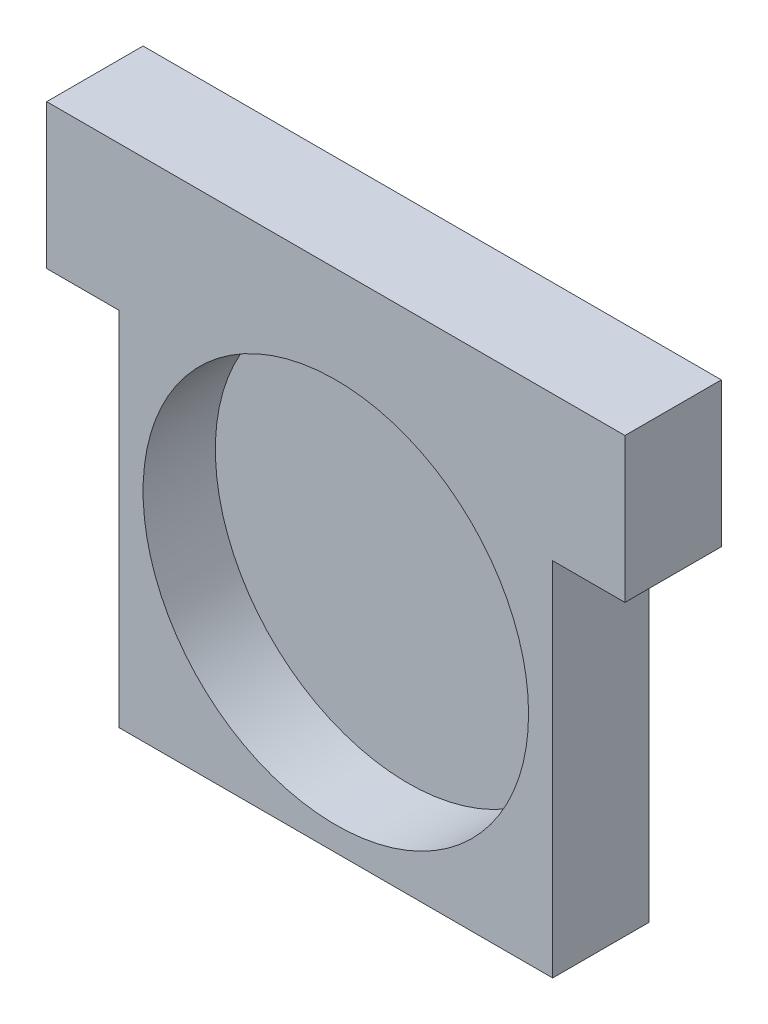
ISO-10303-21;
HEADER;
FILE_DESCRIPTION(('STEP AP214'),'2;1');
FILE_NAME('part.step','',(''),(''),'','','');
FILE_SCHEMA(('AUTOMOTIVE_DESIGN { 1 0 10303 214 1 1 1 1 }'));
ENDSEC;
DATA;
#1=APPLICATION_CONTEXT('core data for automotive mechanical design processes');
#2=APPLICATION_PROTOCOL_DEFINITION('international standard','automotive_design',2000,#1);
#3=PRODUCT_CONTEXT('',#1,'mechanical');
#4=PRODUCT('Part','Part','',(#3));
#5=PRODUCT_RELATED_PRODUCT_CATEGORY('part','',(#4));
#6=PRODUCT_DEFINITION_FORMATION('','',#4);
#7=PRODUCT_DEFINITION_CONTEXT('part definition',#1,'design');
#8=PRODUCT_DEFINITION('design','',#6,#7);
#9=PRODUCT_DEFINITION_SHAPE('','',#8);
#10=(LENGTH_UNIT() NAMED_UNIT(*) SI_UNIT(.MILLI.,.METRE.));
#11=(NAMED_UNIT(*) PLANE_ANGLE_UNIT() SI_UNIT($,.RADIAN.));
#12=(NAMED_UNIT(*) SI_UNIT($,.STERADIAN.) SOLID_ANGLE_UNIT());
#13=UNCERTAINTY_MEASURE_WITH_UNIT(LENGTH_MEASURE(1.E-05),#10,'distance_accuracy_value','');
#14=(GEOMETRIC_REPRESENTATION_CONTEXT(3) GLOBAL_UNCERTAINTY_ASSIGNED_CONTEXT((#13)) GLOBAL_UNIT_ASSIGNED_CONTEXT((#10,
#11,#12)) REPRESENTATION_CONTEXT('',''));
#15=CARTESIAN_POINT('',(0.,0.,0.));
#16=DIRECTION('',(0.,0.,1.));
#17=DIRECTION('',(1.,0.,0.));
#18=AXIS2_PLACEMENT_3D('',#15,#16,#17);
#19=CARTESIAN_POINT('',(38.1,38.1,12.7));
#20=DIRECTION('',(-1.,0.,0.));
#21=DIRECTION('',(0.,-1.,0.));
#22=AXIS2_PLACEMENT_3D('',#19,#20,#21);
#23=PLANE('',#22);
#24=DIRECTION('',(0.,0.,-1.));
#25=VECTOR('',#24,1.);
#26=CARTESIAN_POINT('',(38.1,19.05,164.211059456916));
#27=LINE('',#26,#25);
#28=CARTESIAN_POINT('',(38.1,19.05,12.7));
#29=VERTEX_POINT('',#28);
#30=CARTESIAN_POINT('',(38.1,19.05,0.));
#31=VERTEX_POINT('',#30);
#32=EDGE_CURVE('E130',#29,#31,#27,.T.);
#33=ORIENTED_EDGE('',*,*,#32,.T.);
#34=DIRECTION('',(0.,1.,0.));
#35=VECTOR('',#34,1.);
#36=CARTESIAN_POINT('',(38.1,38.1,0.));
#37=LINE('',#36,#35);
#38=CARTESIAN_POINT('',(38.1,38.1,0.));
#39=VERTEX_POINT('',#38);
#40=EDGE_CURVE('E143',#31,#39,#37,.T.);
#41=ORIENTED_EDGE('',*,*,#40,.T.);
#42=DIRECTION('',(0.,0.,-1.));
#43=VECTOR('',#42,1.);
#44=CARTESIAN_POINT('',(38.1,38.1,12.7));
#45=LINE('',#44,#43);
#46=CARTESIAN_POINT('',(38.1,38.1,12.7));
#47=VERTEX_POINT('',#46);
#48=EDGE_CURVE('E114',#47,#39,#45,.T.);
#49=ORIENTED_EDGE('',*,*,#48,.F.);
#50=DIRECTION('',(0.,1.,0.));
#51=VECTOR('',#50,1.);
#52=CARTESIAN_POINT('',(38.1,38.1,12.7));
#53=LINE('',#52,#51);
#54=EDGE_CURVE('E146',#29,#47,#53,.T.);
#55=ORIENTED_EDGE('',*,*,#54,.F.);
#56=EDGE_LOOP('',(#33,#41,#49,#55));
#57=FACE_BOUND('',#56,.T.);
#58=ADVANCED_FACE('F33',(#57),#23,.F.);
#59=CARTESIAN_POINT('',(-38.1,38.1,12.7));
#60=DIRECTION('',(1.,0.,0.));
#61=DIRECTION('',(0.,1.,0.));
#62=AXIS2_PLACEMENT_3D('',#59,#60,#61);
#63=PLANE('',#62);
#64=DIRECTION('',(0.,0.,-1.));
#65=VECTOR('',#64,1.);
#66=CARTESIAN_POINT('',(-38.1,19.05,164.211059456916));
#67=LINE('',#66,#65);
#68=CARTESIAN_POINT('',(-38.1,19.05,12.7));
#69=VERTEX_POINT('',#68);
#70=CARTESIAN_POINT('',(-38.1,19.05,0.));
#71=VERTEX_POINT('',#70);
#72=EDGE_CURVE('E113',#69,#71,#67,.T.);
#73=ORIENTED_EDGE('',*,*,#72,.F.);
#74=DIRECTION('',(0.,-1.,0.));
#75=VECTOR('',#74,1.);
#76=CARTESIAN_POINT('',(-38.1,38.1,12.7));
#77=LINE('',#76,#75);
#78=CARTESIAN_POINT('',(-38.1,38.1,12.7));
#79=VERTEX_POINT('',#78);
#80=EDGE_CURVE('E151',#79,#69,#77,.T.);
#81=ORIENTED_EDGE('',*,*,#80,.F.);
#82=DIRECTION('',(0.,0.,-1.));
#83=VECTOR('',#82,1.);
#84=CARTESIAN_POINT('',(-38.1,38.1,12.7));
#85=LINE('',#84,#83);
#86=CARTESIAN_POINT('',(-38.1,38.1,0.));
#87=VERTEX_POINT('',#86);
#88=EDGE_CURVE('E154',#79,#87,#85,.T.);
#89=ORIENTED_EDGE('',*,*,#88,.T.);
#90=DIRECTION('',(0.,-1.,0.));
#91=VECTOR('',#90,1.);
#92=CARTESIAN_POINT('',(-38.1,38.1,0.));
#93=LINE('',#92,#91);
#94=EDGE_CURVE('E149',#87,#71,#93,.T.);
#95=ORIENTED_EDGE('',*,*,#94,.T.);
#96=EDGE_LOOP('',(#73,#81,#89,#95));
#97=FACE_BOUND('',#96,.T.);
#98=ADVANCED_FACE('F183',(#97),#63,.F.);
#99=CARTESIAN_POINT('',(0.,0.,12.7));
#100=DIRECTION('',(0.,0.,1.));
#101=DIRECTION('',(1.,0.,0.));
#102=AXIS2_PLACEMENT_3D('',#99,#100,#101);
#103=PLANE('',#102);
#104=CARTESIAN_POINT('',(0.,0.,12.7));
#105=DIRECTION('',(0.,0.,1.));
#106=DIRECTION('',(1.,0.,0.));
#107=AXIS2_PLACEMENT_3D('',#104,#105,#106);
#108=CIRCLE('',#107,25.4);
#109=CARTESIAN_POINT('',(25.4,0.,12.7));
#110=VERTEX_POINT('',#109);
#111=EDGE_CURVE('E139',#110,#110,#108,.T.);
#112=ORIENTED_EDGE('',*,*,#111,.F.);
#113=EDGE_LOOP('',(#112));
#114=FACE_BOUND('',#113,.T.);
#115=DIRECTION('',(0.,1.,0.));
#116=VECTOR('',#115,1.);
#117=CARTESIAN_POINT('',(28.575,0.,12.7));
#118=LINE('',#117,#116);
#119=CARTESIAN_POINT('',(28.575,-28.575,12.7));
#120=VERTEX_POINT('',#119);
#121=CARTESIAN_POINT('',(28.575,19.05,12.7));
#122=VERTEX_POINT('',#121);
#123=EDGE_CURVE('E47',#120,#122,#118,.T.);
#124=ORIENTED_EDGE('',*,*,#123,.T.);
#125=DIRECTION('',(1.,0.,0.));
#126=VECTOR('',#125,1.);
#127=CARTESIAN_POINT('',(0.,19.05,12.7));
#128=LINE('',#127,#126);
#129=EDGE_CURVE('E137',#122,#29,#128,.T.);
#130=ORIENTED_EDGE('',*,*,#129,.T.);
#131=ORIENTED_EDGE('',*,*,#54,.T.);
#132=DIRECTION('',(-1.,0.,0.));
#133=VECTOR('',#132,1.);
#134=CARTESIAN_POINT('',(-38.1,38.1,12.7));
#135=LINE('',#134,#133);
#136=EDGE_CURVE('E148',#47,#79,#135,.T.);
#137=ORIENTED_EDGE('',*,*,#136,.T.);
#138=ORIENTED_EDGE('',*,*,#80,.T.);
#139=DIRECTION('',(1.,0.,0.));
#140=VECTOR('',#139,1.);
#141=CARTESIAN_POINT('',(0.,19.05,12.7));
#142=LINE('',#141,#140);
#143=CARTESIAN_POINT('',(-28.575,19.05,12.7));
#144=VERTEX_POINT('',#143);
#145=EDGE_CURVE('E132',#69,#144,#142,.T.);
#146=ORIENTED_EDGE('',*,*,#145,.T.);
#147=DIRECTION('',(0.,-1.,0.));
#148=VECTOR('',#147,1.);
#149=CARTESIAN_POINT('',(-28.575,0.,12.7));
#150=LINE('',#149,#148);
#151=CARTESIAN_POINT('',(-28.575,-28.575,12.7));
#152=VERTEX_POINT('',#151);
#153=EDGE_CURVE('E118',#144,#152,#150,.T.);
#154=ORIENTED_EDGE('',*,*,#153,.T.);
#155=DIRECTION('',(1.,0.,0.));
#156=VECTOR('',#155,1.);
#157=CARTESIAN_POINT('',(0.,-28.575,12.7));
#158=LINE('',#157,#156);
#159=EDGE_CURVE('E52',#152,#120,#158,.T.);
#160=ORIENTED_EDGE('',*,*,#159,.T.);
#161=EDGE_LOOP('',(#124,#130,#131,#137,#138,#146,#154,#160));
#162=FACE_BOUND('',#161,.T.);
#163=ADVANCED_FACE('F172',(#114,#162),#103,.T.);
#164=CARTESIAN_POINT('',(0.,0.,0.));
#165=DIRECTION('',(0.,0.,1.));
#166=DIRECTION('',(1.,0.,0.));
#167=AXIS2_PLACEMENT_3D('',#164,#165,#166);
#168=PLANE('',#167);
#169=DIRECTION('',(1.,0.,0.));
#170=VECTOR('',#169,1.);
#171=CARTESIAN_POINT('',(0.,19.05,0.));
#172=LINE('',#171,#170);
#173=CARTESIAN_POINT('',(28.575,19.05,0.));
#174=VERTEX_POINT('',#173);
#175=EDGE_CURVE('E11',#174,#31,#172,.T.);
#176=ORIENTED_EDGE('',*,*,#175,.F.);
#177=DIRECTION('',(0.,1.,0.));
#178=VECTOR('',#177,1.);
#179=CARTESIAN_POINT('',(28.575,0.,0.));
#180=LINE('',#179,#178);
#181=CARTESIAN_POINT('',(28.575,-28.575,0.));
#182=VERTEX_POINT('',#181);
#183=EDGE_CURVE('E40',#182,#174,#180,.T.);
#184=ORIENTED_EDGE('',*,*,#183,.F.);
#185=DIRECTION('',(1.,0.,0.));
#186=VECTOR('',#185,1.);
#187=CARTESIAN_POINT('',(0.,-28.575,0.));
#188=LINE('',#187,#186);
#189=CARTESIAN_POINT('',(-28.575,-28.575,0.));
#190=VERTEX_POINT('',#189);
#191=EDGE_CURVE('E101',#190,#182,#188,.T.);
#192=ORIENTED_EDGE('',*,*,#191,.F.);
#193=DIRECTION('',(0.,-1.,0.));
#194=VECTOR('',#193,1.);
#195=CARTESIAN_POINT('',(-28.575,0.,0.));
#196=LINE('',#195,#194);
#197=CARTESIAN_POINT('',(-28.575,19.05,0.));
#198=VERTEX_POINT('',#197);
#199=EDGE_CURVE('E94',#198,#190,#196,.T.);
#200=ORIENTED_EDGE('',*,*,#199,.F.);
#201=DIRECTION('',(1.,0.,0.));
#202=VECTOR('',#201,1.);
#203=CARTESIAN_POINT('',(0.,19.05,0.));
#204=LINE('',#203,#202);
#205=EDGE_CURVE('E98',#71,#198,#204,.T.);
#206=ORIENTED_EDGE('',*,*,#205,.F.);
#207=ORIENTED_EDGE('',*,*,#94,.F.);
#208=DIRECTION('',(-1.,0.,0.));
#209=VECTOR('',#208,1.);
#210=CARTESIAN_POINT('',(-38.1,38.1,0.));
#211=LINE('',#210,#209);
#212=EDGE_CURVE('E156',#39,#87,#211,.T.);
#213=ORIENTED_EDGE('',*,*,#212,.F.);
#214=ORIENTED_EDGE('',*,*,#40,.F.);
#215=EDGE_LOOP('',(#176,#184,#192,#200,#206,#207,#213,#214));
#216=FACE_BOUND('',#215,.T.);
#217=ADVANCED_FACE('F96',(#216),#168,.F.);
#218=CARTESIAN_POINT('',(-38.1,38.1,12.7));
#219=DIRECTION('',(0.,-1.,0.));
#220=DIRECTION('',(0.,0.,-1.));
#221=AXIS2_PLACEMENT_3D('',#218,#219,#220);
#222=PLANE('',#221);
#223=ORIENTED_EDGE('',*,*,#212,.T.);
#224=ORIENTED_EDGE('',*,*,#88,.F.);
#225=ORIENTED_EDGE('',*,*,#136,.F.);
#226=ORIENTED_EDGE('',*,*,#48,.T.);
#227=EDGE_LOOP('',(#223,#224,#225,#226));
#228=FACE_BOUND('',#227,.T.);
#229=ADVANCED_FACE('F179',(#228),#222,.F.);
#230=CARTESIAN_POINT('',(0.,0.,3.175));
#231=DIRECTION('',(0.,0.,1.));
#232=DIRECTION('',(1.,0.,0.));
#233=AXIS2_PLACEMENT_3D('',#230,#231,#232);
#234=CYLINDRICAL_SURFACE('',#233,25.4);
#235=CARTESIAN_POINT('',(0.,0.,3.175));
#236=DIRECTION('',(0.,0.,1.));
#237=DIRECTION('',(1.,0.,0.));
#238=AXIS2_PLACEMENT_3D('',#235,#236,#237);
#239=CIRCLE('',#238,25.4);
#240=CARTESIAN_POINT('',(25.4,0.,3.175));
#241=VERTEX_POINT('',#240);
#242=EDGE_CURVE('E140',#241,#241,#239,.T.);
#243=ORIENTED_EDGE('',*,*,#242,.F.);
#244=EDGE_LOOP('',(#243));
#245=FACE_BOUND('',#244,.T.);
#246=ORIENTED_EDGE('',*,*,#111,.T.);
#247=EDGE_LOOP('',(#246));
#248=FACE_BOUND('',#247,.T.);
#249=ADVANCED_FACE('F194',(#245,#248),#234,.F.);
#250=CARTESIAN_POINT('',(0.,0.,3.175));
#251=DIRECTION('',(0.,0.,1.));
#252=DIRECTION('',(1.,0.,0.));
#253=AXIS2_PLACEMENT_3D('',#250,#251,#252);
#254=PLANE('',#253);
#255=ORIENTED_EDGE('',*,*,#242,.T.);
#256=EDGE_LOOP('',(#255));
#257=FACE_BOUND('',#256,.T.);
#258=ADVANCED_FACE('F199',(#257),#254,.T.);
#259=CARTESIAN_POINT('',(38.1,19.05,164.211059456916));
#260=DIRECTION('',(0.,-1.,0.));
#261=DIRECTION('',(1.,0.,0.));
#262=AXIS2_PLACEMENT_3D('',#259,#260,#261);
#263=PLANE('',#262);
#264=ORIENTED_EDGE('',*,*,#129,.F.);
#265=DIRECTION('',(0.,0.,-1.));
#266=VECTOR('',#265,1.);
#267=CARTESIAN_POINT('',(28.575,19.05,164.211059456916));
#268=LINE('',#267,#266);
#269=EDGE_CURVE('E127',#122,#174,#268,.T.);
#270=ORIENTED_EDGE('',*,*,#269,.T.);
#271=ORIENTED_EDGE('',*,*,#175,.T.);
#272=ORIENTED_EDGE('',*,*,#32,.F.);
#273=EDGE_LOOP('',(#264,#270,#271,#272));
#274=FACE_BOUND('',#273,.T.);
#275=ADVANCED_FACE('F169',(#274),#263,.T.);
#276=CARTESIAN_POINT('',(28.575,19.05,164.211059456916));
#277=DIRECTION('',(1.,0.,0.));
#278=DIRECTION('',(0.,0.,-1.));
#279=AXIS2_PLACEMENT_3D('',#276,#277,#278);
#280=PLANE('',#279);
#281=ORIENTED_EDGE('',*,*,#123,.F.);
#282=DIRECTION('',(0.,0.,-1.));
#283=VECTOR('',#282,1.);
#284=CARTESIAN_POINT('',(28.575,-28.575,164.211059456916));
#285=LINE('',#284,#283);
#286=EDGE_CURVE('E124',#120,#182,#285,.T.);
#287=ORIENTED_EDGE('',*,*,#286,.T.);
#288=ORIENTED_EDGE('',*,*,#183,.T.);
#289=ORIENTED_EDGE('',*,*,#269,.F.);
#290=EDGE_LOOP('',(#281,#287,#288,#289));
#291=FACE_BOUND('',#290,.T.);
#292=ADVANCED_FACE('F166',(#291),#280,.T.);
#293=CARTESIAN_POINT('',(28.575,-28.575,164.211059456916));
#294=DIRECTION('',(0.,-1.,0.));
#295=DIRECTION('',(0.,0.,-1.));
#296=AXIS2_PLACEMENT_3D('',#293,#294,#295);
#297=PLANE('',#296);
#298=ORIENTED_EDGE('',*,*,#159,.F.);
#299=DIRECTION('',(0.,0.,-1.));
#300=VECTOR('',#299,1.);
#301=CARTESIAN_POINT('',(-28.575,-28.575,164.211059456916));
#302=LINE('',#301,#300);
#303=EDGE_CURVE('E120',#152,#190,#302,.T.);
#304=ORIENTED_EDGE('',*,*,#303,.T.);
#305=ORIENTED_EDGE('',*,*,#191,.T.);
#306=ORIENTED_EDGE('',*,*,#286,.F.);
#307=EDGE_LOOP('',(#298,#304,#305,#306));
#308=FACE_BOUND('',#307,.T.);
#309=ADVANCED_FACE('F251',(#308),#297,.T.);
#310=CARTESIAN_POINT('',(-28.575,-28.575,164.211059456916));
#311=DIRECTION('',(-1.,0.,0.));
#312=DIRECTION('',(0.,0.,1.));
#313=AXIS2_PLACEMENT_3D('',#310,#311,#312);
#314=PLANE('',#313);
#315=ORIENTED_EDGE('',*,*,#153,.F.);
#316=DIRECTION('',(0.,0.,-1.));
#317=VECTOR('',#316,1.);
#318=CARTESIAN_POINT('',(-28.575,19.05,164.211059456916));
#319=LINE('',#318,#317);
#320=EDGE_CURVE('E112',#144,#198,#319,.T.);
#321=ORIENTED_EDGE('',*,*,#320,.T.);
#322=ORIENTED_EDGE('',*,*,#199,.T.);
#323=ORIENTED_EDGE('',*,*,#303,.F.);
#324=EDGE_LOOP('',(#315,#321,#322,#323));
#325=FACE_BOUND('',#324,.T.);
#326=ADVANCED_FACE('F117',(#325),#314,.T.);
#327=CARTESIAN_POINT('',(-28.575,19.05,164.211059456916));
#328=DIRECTION('',(0.,-1.,0.));
#329=DIRECTION('',(0.,0.,-1.));
#330=AXIS2_PLACEMENT_3D('',#327,#328,#329);
#331=PLANE('',#330);
#332=ORIENTED_EDGE('',*,*,#145,.F.);
#333=ORIENTED_EDGE('',*,*,#72,.T.);
#334=ORIENTED_EDGE('',*,*,#205,.T.);
#335=ORIENTED_EDGE('',*,*,#320,.F.);
#336=EDGE_LOOP('',(#332,#333,#334,#335));
#337=FACE_BOUND('',#336,.T.);
#338=ADVANCED_FACE('F111',(#337),#331,.T.);
#339=CLOSED_SHELL('',(#58,#98,#163,#217,#229,#249,#258,#275,#292,#309,#326,#338));
#340=MANIFOLD_SOLID_BREP('B2',#339);
#341=ADVANCED_BREP_SHAPE_REPRESENTATION('',(#18,#340),#14);
#342=SHAPE_DEFINITION_REPRESENTATION(#9,#341);
ENDSEC;
END-ISO-10303-21;
